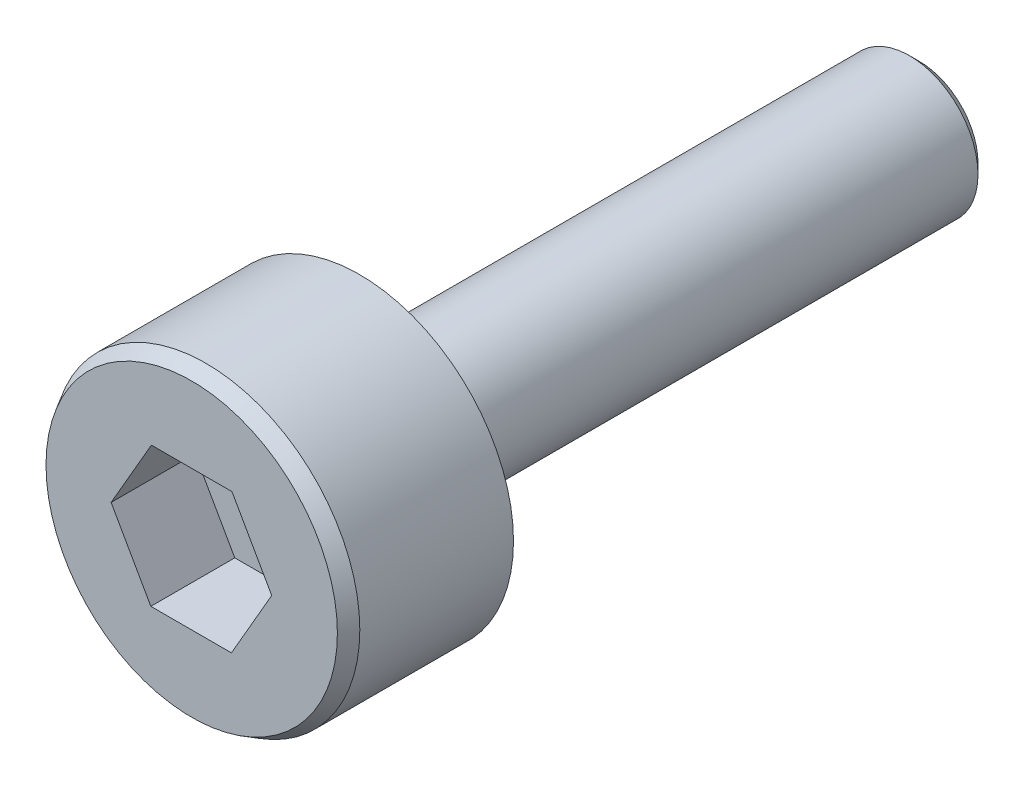
ISO-10303-21;
HEADER;
FILE_DESCRIPTION(('STEP AP214'),'2;1');
FILE_NAME('part.step','',(''),(''),'','','');
FILE_SCHEMA(('AUTOMOTIVE_DESIGN { 1 0 10303 214 1 1 1 1 }'));
ENDSEC;
DATA;
#1=APPLICATION_CONTEXT('core data for automotive mechanical design processes');
#2=APPLICATION_PROTOCOL_DEFINITION('international standard','automotive_design',2000,#1);
#3=PRODUCT_CONTEXT('',#1,'mechanical');
#4=PRODUCT('Part','Part','',(#3));
#5=PRODUCT_RELATED_PRODUCT_CATEGORY('part','',(#4));
#6=PRODUCT_DEFINITION_FORMATION('','',#4);
#7=PRODUCT_DEFINITION_CONTEXT('part definition',#1,'design');
#8=PRODUCT_DEFINITION('design','',#6,#7);
#9=PRODUCT_DEFINITION_SHAPE('','',#8);
#10=(LENGTH_UNIT() NAMED_UNIT(*) SI_UNIT(.MILLI.,.METRE.));
#11=(NAMED_UNIT(*) PLANE_ANGLE_UNIT() SI_UNIT($,.RADIAN.));
#12=(NAMED_UNIT(*) SI_UNIT($,.STERADIAN.) SOLID_ANGLE_UNIT());
#13=UNCERTAINTY_MEASURE_WITH_UNIT(LENGTH_MEASURE(1.E-05),#10,'distance_accuracy_value','');
#14=(GEOMETRIC_REPRESENTATION_CONTEXT(3) GLOBAL_UNCERTAINTY_ASSIGNED_CONTEXT((#13)) GLOBAL_UNIT_ASSIGNED_CONTEXT((#10,
#11,#12)) REPRESENTATION_CONTEXT('',''));
#15=CARTESIAN_POINT('',(0.,0.,0.));
#16=DIRECTION('',(0.,0.,1.));
#17=DIRECTION('',(1.,0.,0.));
#18=AXIS2_PLACEMENT_3D('',#15,#16,#17);
#19=CARTESIAN_POINT('',(4.44089209850063E-13,0.,-9.82500000000108));
#20=DIRECTION('',(0.,0.,1.));
#21=DIRECTION('',(0.999999999999996,0.,0.));
#22=AXIS2_PLACEMENT_3D('',#19,#20,#21);
#23=CONICAL_SURFACE('',#22,1.225,0.785398163397443);
#24=CARTESIAN_POINT('',(4.44089209850063E-13,0.,-9.82500000000108));
#25=DIRECTION('',(0.,0.,1.));
#26=DIRECTION('',(0.999999999999996,0.,0.));
#27=AXIS2_PLACEMENT_3D('',#24,#25,#26);
#28=CIRCLE('',#27,1.225);
#29=CARTESIAN_POINT('',(1.22500000000044,0.,-9.82500000000108));
#30=VERTEX_POINT('',#29);
#31=EDGE_CURVE('E128',#30,#30,#28,.T.);
#32=ORIENTED_EDGE('',*,*,#31,.F.);
#33=EDGE_LOOP('',(#32));
#34=FACE_BOUND('',#33,.T.);
#35=CARTESIAN_POINT('',(8.88178419700125E-13,-1.77635683940025E-12,-9.99999999999623));
#36=DIRECTION('',(0.,0.,-1.));
#37=DIRECTION('',(0.999999999999996,0.,0.));
#38=AXIS2_PLACEMENT_3D('',#35,#36,#37);
#39=CIRCLE('',#38,1.05);
#40=CARTESIAN_POINT('',(1.05000000000088,-1.77822201408162E-12,-9.99999999999624));
#41=VERTEX_POINT('',#40);
#42=EDGE_CURVE('E132',#41,#41,#39,.T.);
#43=ORIENTED_EDGE('',*,*,#42,.F.);
#44=EDGE_LOOP('',(#43));
#45=FACE_BOUND('',#44,.T.);
#46=ADVANCED_FACE('F16',(#34,#45),#23,.T.);
#47=CARTESIAN_POINT('',(0.,-2.66453525910038E-12,3.00000000000278));
#48=DIRECTION('',(0.,0.,-1.));
#49=DIRECTION('',(-0.999999999999996,0.,0.));
#50=AXIS2_PLACEMENT_3D('',#47,#48,#49);
#51=CONICAL_SURFACE('',#50,2.60335303162583,0.523598775598305);
#52=CARTESIAN_POINT('',(0.,-1.15463194561016E-11,2.74600000000369));
#53=DIRECTION('',(0.,0.,-1.));
#54=DIRECTION('',(0.999999999999996,0.,0.));
#55=AXIS2_PLACEMENT_3D('',#52,#53,#54);
#56=CIRCLE('',#55,2.75);
#57=CARTESIAN_POINT('',(2.74999999999999,-1.155120443741E-11,2.74600000000369));
#58=VERTEX_POINT('',#57);
#59=EDGE_CURVE('E11',#58,#58,#56,.T.);
#60=ORIENTED_EDGE('',*,*,#59,.F.);
#61=EDGE_LOOP('',(#60));
#62=FACE_BOUND('',#61,.T.);
#63=CARTESIAN_POINT('',(0.,-2.66453525910038E-12,3.00000000000278));
#64=DIRECTION('',(0.,0.,1.));
#65=DIRECTION('',(0.999999999999996,0.,0.));
#66=AXIS2_PLACEMENT_3D('',#63,#64,#65);
#67=CIRCLE('',#66,2.60335303162583);
#68=CARTESIAN_POINT('',(2.60335303162582,-2.66915974306348E-12,3.00000000000277));
#69=VERTEX_POINT('',#68);
#70=EDGE_CURVE('E126',#69,#69,#67,.T.);
#71=ORIENTED_EDGE('',*,*,#70,.F.);
#72=EDGE_LOOP('',(#71));
#73=FACE_BOUND('',#72,.T.);
#74=ADVANCED_FACE('F141',(#62,#73),#51,.T.);
#75=CARTESIAN_POINT('',(0.,-2.66453525910038E-12,3.00000000000278));
#76=DIRECTION('',(0.,0.,-1.));
#77=DIRECTION('',(-0.999999999999996,0.,0.));
#78=AXIS2_PLACEMENT_3D('',#75,#76,#77);
#79=CYLINDRICAL_SURFACE('',#78,2.75);
#80=CARTESIAN_POINT('',(0.,0.,0.));
#81=DIRECTION('',(0.,0.,1.));
#82=DIRECTION('',(0.999999999999996,0.,0.));
#83=AXIS2_PLACEMENT_3D('',#80,#81,#82);
#84=CIRCLE('',#83,2.75);
#85=CARTESIAN_POINT('',(2.74999999999999,0.,0.));
#86=VERTEX_POINT('',#85);
#87=EDGE_CURVE('E26',#86,#86,#84,.T.);
#88=ORIENTED_EDGE('',*,*,#87,.T.);
#89=EDGE_LOOP('',(#88));
#90=FACE_BOUND('',#89,.T.);
#91=ORIENTED_EDGE('',*,*,#59,.T.);
#92=EDGE_LOOP('',(#91));
#93=FACE_BOUND('',#92,.T.);
#94=ADVANCED_FACE('F150',(#90,#93),#79,.T.);
#95=CARTESIAN_POINT('',(8.88178419700125E-13,-1.77635683940025E-12,-9.99999999999623));
#96=DIRECTION('',(0.,0.,1.));
#97=DIRECTION('',(0.999999999999996,0.,0.));
#98=AXIS2_PLACEMENT_3D('',#95,#96,#97);
#99=CYLINDRICAL_SURFACE('',#98,1.225);
#100=CARTESIAN_POINT('',(0.,0.,0.));
#101=DIRECTION('',(0.,0.,1.));
#102=DIRECTION('',(0.999999999999996,0.,0.));
#103=AXIS2_PLACEMENT_3D('',#100,#101,#102);
#104=CIRCLE('',#103,1.225);
#105=CARTESIAN_POINT('',(1.225,0.,0.));
#106=VERTEX_POINT('',#105);
#107=EDGE_CURVE('E123',#106,#106,#104,.T.);
#108=ORIENTED_EDGE('',*,*,#107,.F.);
#109=EDGE_LOOP('',(#108));
#110=FACE_BOUND('',#109,.T.);
#111=ORIENTED_EDGE('',*,*,#31,.T.);
#112=EDGE_LOOP('',(#111));
#113=FACE_BOUND('',#112,.T.);
#114=ADVANCED_FACE('F157',(#110,#113),#99,.T.);
#115=CARTESIAN_POINT('',(8.88178419700125E-13,-1.77635683940025E-12,-9.99999999999623));
#116=DIRECTION('',(0.,0.,1.));
#117=DIRECTION('',(0.999999999999996,0.,0.));
#118=AXIS2_PLACEMENT_3D('',#115,#116,#117);
#119=PLANE('',#118);
#120=ORIENTED_EDGE('',*,*,#42,.T.);
#121=EDGE_LOOP('',(#120));
#122=FACE_BOUND('',#121,.T.);
#123=ADVANCED_FACE('F138',(#122),#119,.F.);
#124=CARTESIAN_POINT('',(0.,-2.66453525910038E-12,3.00000000000278));
#125=DIRECTION('',(0.,0.,1.));
#126=DIRECTION('',(0.999999999999996,0.,0.));
#127=AXIS2_PLACEMENT_3D('',#124,#125,#126);
#128=PLANE('',#127);
#129=DIRECTION('',(-0.492900458415129,0.870085707326675,0.));
#130=VECTOR('',#129,1.);
#131=CARTESIAN_POINT('',(1.42977666011779,-0.00292341855612221,3.000000000001));
#132=LINE('',#131,#130);
#133=CARTESIAN_POINT('',(1.42977666011779,-0.00292341855612221,3.000000000001));
#134=VERTEX_POINT('',#133);
#135=CARTESIAN_POINT('',(0.720000000000054,1.24999999999531,2.99999999999923));
#136=VERTEX_POINT('',#135);
#137=EDGE_CURVE('E101',#134,#136,#132,.T.);
#138=ORIENTED_EDGE('',*,*,#137,.F.);
#139=DIRECTION('',(0.499999999999995,0.86602540378444,0.));
#140=VECTOR('',#139,1.);
#141=CARTESIAN_POINT('',(0.709776660117845,-1.25000000000863,3.00000000000811));
#142=LINE('',#141,#140);
#143=CARTESIAN_POINT('',(0.709776660117845,-1.25000000000863,3.00000000000811));
#144=VERTEX_POINT('',#143);
#145=EDGE_CURVE('E35',#144,#134,#142,.T.);
#146=ORIENTED_EDGE('',*,*,#145,.F.);
#147=DIRECTION('',(0.999999999999996,0.,0.));
#148=VECTOR('',#147,1.);
#149=CARTESIAN_POINT('',(-0.730223339882152,-1.25000000000863,3.00000000000811));
#150=LINE('',#149,#148);
#151=CARTESIAN_POINT('',(-0.730223339882152,-1.25000000000863,3.00000000000811));
#152=VERTEX_POINT('',#151);
#153=EDGE_CURVE('E107',#152,#144,#150,.T.);
#154=ORIENTED_EDGE('',*,*,#153,.F.);
#155=DIRECTION('',(0.49290045841513,-0.870085707326675,0.));
#156=VECTOR('',#155,1.);
#157=CARTESIAN_POINT('',(-1.44,0.00292341854546407,3.00000000001077));
#158=LINE('',#157,#156);
#159=CARTESIAN_POINT('',(-1.44,0.00292341854546407,3.00000000001077));
#160=VERTEX_POINT('',#159);
#161=EDGE_CURVE('E113',#160,#152,#158,.T.);
#162=ORIENTED_EDGE('',*,*,#161,.F.);
#163=DIRECTION('',(-0.499999999999994,-0.86602540378444,0.));
#164=VECTOR('',#163,1.);
#165=CARTESIAN_POINT('',(-0.719999999999943,1.24999999999531,2.99999999999923));
#166=LINE('',#165,#164);
#167=CARTESIAN_POINT('',(-0.719999999999943,1.24999999999531,2.99999999999923));
#168=VERTEX_POINT('',#167);
#169=EDGE_CURVE('E89',#168,#160,#166,.T.);
#170=ORIENTED_EDGE('',*,*,#169,.F.);
#171=DIRECTION('',(-0.999999999999996,0.,0.));
#172=VECTOR('',#171,1.);
#173=CARTESIAN_POINT('',(0.720000000000054,1.24999999999531,2.99999999999923));
#174=LINE('',#173,#172);
#175=EDGE_CURVE('E87',#136,#168,#174,.T.);
#176=ORIENTED_EDGE('',*,*,#175,.F.);
#177=EDGE_LOOP('',(#138,#146,#154,#162,#170,#176));
#178=FACE_BOUND('',#177,.T.);
#179=ORIENTED_EDGE('',*,*,#70,.T.);
#180=EDGE_LOOP('',(#179));
#181=FACE_BOUND('',#180,.T.);
#182=ADVANCED_FACE('F164',(#178,#181),#128,.T.);
#183=CARTESIAN_POINT('',(0.,0.,0.));
#184=DIRECTION('',(0.,0.,1.));
#185=DIRECTION('',(0.999999999999996,0.,0.));
#186=AXIS2_PLACEMENT_3D('',#183,#184,#185);
#187=PLANE('',#186);
#188=ORIENTED_EDGE('',*,*,#107,.T.);
#189=EDGE_LOOP('',(#188));
#190=FACE_BOUND('',#189,.T.);
#191=ORIENTED_EDGE('',*,*,#87,.F.);
#192=EDGE_LOOP('',(#191));
#193=FACE_BOUND('',#192,.T.);
#194=ADVANCED_FACE('F167',(#190,#193),#187,.F.);
#195=CARTESIAN_POINT('',(1.42977666011779,-0.00292341855079314,1.49999999999739));
#196=DIRECTION('',(0.870085707326668,0.492900458415129,0.));
#197=DIRECTION('',(-0.492900458415129,0.870085707326675,0.));
#198=AXIS2_PLACEMENT_3D('',#195,#196,#197);
#199=PLANE('',#198);
#200=ORIENTED_EDGE('',*,*,#137,.T.);
#201=DIRECTION('',(0.,0.,1.));
#202=VECTOR('',#201,1.);
#203=CARTESIAN_POINT('',(0.720000000000054,1.24999999999176,1.5000000000045));
#204=LINE('',#203,#202);
#205=CARTESIAN_POINT('',(0.720000000000054,1.24999999999176,1.5000000000045));
#206=VERTEX_POINT('',#205);
#207=EDGE_CURVE('E93',#206,#136,#204,.T.);
#208=ORIENTED_EDGE('',*,*,#207,.F.);
#209=DIRECTION('',(-0.492900458415129,0.870085707326675,0.));
#210=VECTOR('',#209,1.);
#211=CARTESIAN_POINT('',(1.42977666011779,-0.00292341855079314,1.49999999999739));
#212=LINE('',#211,#210);
#213=CARTESIAN_POINT('',(1.42977666011779,-0.00292341855079314,1.49999999999739));
#214=VERTEX_POINT('',#213);
#215=EDGE_CURVE('E91',#214,#206,#212,.T.);
#216=ORIENTED_EDGE('',*,*,#215,.F.);
#217=DIRECTION('',(0.,0.,1.));
#218=VECTOR('',#217,1.);
#219=CARTESIAN_POINT('',(1.42977666011779,-0.00292341855079314,1.49999999999739));
#220=LINE('',#219,#218);
#221=EDGE_CURVE('E98',#214,#134,#220,.T.);
#222=ORIENTED_EDGE('',*,*,#221,.T.);
#223=EDGE_LOOP('',(#200,#208,#216,#222));
#224=FACE_BOUND('',#223,.T.);
#225=ADVANCED_FACE('F171',(#224),#199,.F.);
#226=CARTESIAN_POINT('',(0.709776660117845,-1.25000000000686,1.50000000000716));
#227=DIRECTION('',(0.866025403784437,-0.500000000000001,0.));
#228=DIRECTION('',(0.499999999999995,0.86602540378444,0.));
#229=AXIS2_PLACEMENT_3D('',#226,#227,#228);
#230=PLANE('',#229);
#231=ORIENTED_EDGE('',*,*,#145,.T.);
#232=ORIENTED_EDGE('',*,*,#221,.F.);
#233=DIRECTION('',(0.499999999999995,0.86602540378444,0.));
#234=VECTOR('',#233,1.);
#235=CARTESIAN_POINT('',(0.709776660117845,-1.25000000000686,1.50000000000716));
#236=LINE('',#235,#234);
#237=CARTESIAN_POINT('',(0.709776660117845,-1.25000000000686,1.50000000000716));
#238=VERTEX_POINT('',#237);
#239=EDGE_CURVE('E102',#238,#214,#236,.T.);
#240=ORIENTED_EDGE('',*,*,#239,.F.);
#241=DIRECTION('',(0.,0.,1.));
#242=VECTOR('',#241,1.);
#243=CARTESIAN_POINT('',(0.709776660117845,-1.25000000000686,1.50000000000716));
#244=LINE('',#243,#242);
#245=EDGE_CURVE('E105',#238,#144,#244,.T.);
#246=ORIENTED_EDGE('',*,*,#245,.T.);
#247=EDGE_LOOP('',(#231,#232,#240,#246));
#248=FACE_BOUND('',#247,.T.);
#249=ADVANCED_FACE('F175',(#248),#230,.F.);
#250=CARTESIAN_POINT('',(-0.730223339882263,-1.25000000000686,1.50000000000716));
#251=DIRECTION('',(0.,-1.,0.));
#252=DIRECTION('',(0.,0.,-1.));
#253=AXIS2_PLACEMENT_3D('',#250,#251,#252);
#254=PLANE('',#253);
#255=ORIENTED_EDGE('',*,*,#153,.T.);
#256=ORIENTED_EDGE('',*,*,#245,.F.);
#257=DIRECTION('',(0.999999999999996,0.,0.));
#258=VECTOR('',#257,1.);
#259=CARTESIAN_POINT('',(-0.730223339882263,-1.25000000000686,1.50000000000716));
#260=LINE('',#259,#258);
#261=CARTESIAN_POINT('',(-0.730223339882263,-1.25000000000686,1.50000000000716));
#262=VERTEX_POINT('',#261);
#263=EDGE_CURVE('E104',#262,#238,#260,.T.);
#264=ORIENTED_EDGE('',*,*,#263,.F.);
#265=DIRECTION('',(0.,0.,1.));
#266=VECTOR('',#265,1.);
#267=CARTESIAN_POINT('',(-0.730223339882263,-1.25000000000686,1.50000000000716));
#268=LINE('',#267,#266);
#269=EDGE_CURVE('E110',#262,#152,#268,.T.);
#270=ORIENTED_EDGE('',*,*,#269,.T.);
#271=EDGE_LOOP('',(#255,#256,#264,#270));
#272=FACE_BOUND('',#271,.T.);
#273=ADVANCED_FACE('F179',(#272),#254,.F.);
#274=CARTESIAN_POINT('',(-1.44,0.00292341854546407,1.50000000000006));
#275=DIRECTION('',(-0.870085707326668,-0.492900458415129,0.));
#276=DIRECTION('',(0.49290045841513,-0.870085707326675,0.));
#277=AXIS2_PLACEMENT_3D('',#274,#275,#276);
#278=PLANE('',#277);
#279=ORIENTED_EDGE('',*,*,#161,.T.);
#280=ORIENTED_EDGE('',*,*,#269,.F.);
#281=DIRECTION('',(0.49290045841513,-0.870085707326675,0.));
#282=VECTOR('',#281,1.);
#283=CARTESIAN_POINT('',(-1.44,0.00292341854546407,1.50000000000006));
#284=LINE('',#283,#282);
#285=CARTESIAN_POINT('',(-1.44,0.00292341854546407,1.50000000000006));
#286=VERTEX_POINT('',#285);
#287=EDGE_CURVE('E69',#286,#262,#284,.T.);
#288=ORIENTED_EDGE('',*,*,#287,.F.);
#289=DIRECTION('',(0.,0.,1.));
#290=VECTOR('',#289,1.);
#291=CARTESIAN_POINT('',(-1.44,0.00292341854546407,1.50000000000006));
#292=LINE('',#291,#290);
#293=EDGE_CURVE('E79',#286,#160,#292,.T.);
#294=ORIENTED_EDGE('',*,*,#293,.T.);
#295=EDGE_LOOP('',(#279,#280,#288,#294));
#296=FACE_BOUND('',#295,.T.);
#297=ADVANCED_FACE('F182',(#296),#278,.F.);
#298=CARTESIAN_POINT('',(-0.719999999999943,1.24999999999176,1.5000000000045));
#299=DIRECTION('',(-0.866025403784437,0.500000000000001,0.));
#300=DIRECTION('',(-0.499999999999994,-0.86602540378444,0.));
#301=AXIS2_PLACEMENT_3D('',#298,#299,#300);
#302=PLANE('',#301);
#303=ORIENTED_EDGE('',*,*,#169,.T.);
#304=ORIENTED_EDGE('',*,*,#293,.F.);
#305=DIRECTION('',(-0.499999999999994,-0.86602540378444,0.));
#306=VECTOR('',#305,1.);
#307=CARTESIAN_POINT('',(-0.719999999999943,1.24999999999176,1.5000000000045));
#308=LINE('',#307,#306);
#309=CARTESIAN_POINT('',(-0.719999999999943,1.24999999999176,1.5000000000045));
#310=VERTEX_POINT('',#309);
#311=EDGE_CURVE('E75',#310,#286,#308,.T.);
#312=ORIENTED_EDGE('',*,*,#311,.F.);
#313=DIRECTION('',(0.,0.,1.));
#314=VECTOR('',#313,1.);
#315=CARTESIAN_POINT('',(-0.719999999999943,1.24999999999176,1.5000000000045));
#316=LINE('',#315,#314);
#317=EDGE_CURVE('E78',#310,#168,#316,.T.);
#318=ORIENTED_EDGE('',*,*,#317,.T.);
#319=EDGE_LOOP('',(#303,#304,#312,#318));
#320=FACE_BOUND('',#319,.T.);
#321=ADVANCED_FACE('F77',(#320),#302,.F.);
#322=CARTESIAN_POINT('',(0.720000000000054,1.24999999999176,1.5000000000045));
#323=DIRECTION('',(0.,1.,0.));
#324=DIRECTION('',(-0.999999999999996,0.,0.));
#325=AXIS2_PLACEMENT_3D('',#322,#323,#324);
#326=PLANE('',#325);
#327=ORIENTED_EDGE('',*,*,#175,.T.);
#328=ORIENTED_EDGE('',*,*,#317,.F.);
#329=DIRECTION('',(-0.999999999999996,0.,0.));
#330=VECTOR('',#329,1.);
#331=CARTESIAN_POINT('',(0.720000000000054,1.24999999999176,1.5000000000045));
#332=LINE('',#331,#330);
#333=EDGE_CURVE('E20',#206,#310,#332,.T.);
#334=ORIENTED_EDGE('',*,*,#333,.F.);
#335=ORIENTED_EDGE('',*,*,#207,.T.);
#336=EDGE_LOOP('',(#327,#328,#334,#335));
#337=FACE_BOUND('',#336,.T.);
#338=ADVANCED_FACE('F85',(#337),#326,.F.);
#339=CARTESIAN_POINT('',(0.720000000000054,1.24999999999176,1.5000000000045));
#340=DIRECTION('',(0.,0.,1.));
#341=DIRECTION('',(0.999999999999996,0.,0.));
#342=AXIS2_PLACEMENT_3D('',#339,#340,#341);
#343=PLANE('',#342);
#344=ORIENTED_EDGE('',*,*,#215,.T.);
#345=ORIENTED_EDGE('',*,*,#333,.T.);
#346=ORIENTED_EDGE('',*,*,#311,.T.);
#347=ORIENTED_EDGE('',*,*,#287,.T.);
#348=ORIENTED_EDGE('',*,*,#263,.T.);
#349=ORIENTED_EDGE('',*,*,#239,.T.);
#350=EDGE_LOOP('',(#344,#345,#346,#347,#348,#349));
#351=FACE_BOUND('',#350,.T.);
#352=ADVANCED_FACE('F18',(#351),#343,.T.);
#353=CLOSED_SHELL('',(#46,#74,#94,#114,#123,#182,#194,#225,#249,#273,#297,#321,#338,#352));
#354=MANIFOLD_SOLID_BREP('B1',#353);
#355=ADVANCED_BREP_SHAPE_REPRESENTATION('',(#18,#354),#14);
#356=SHAPE_DEFINITION_REPRESENTATION(#9,#355);
ENDSEC;
END-ISO-10303-21;
